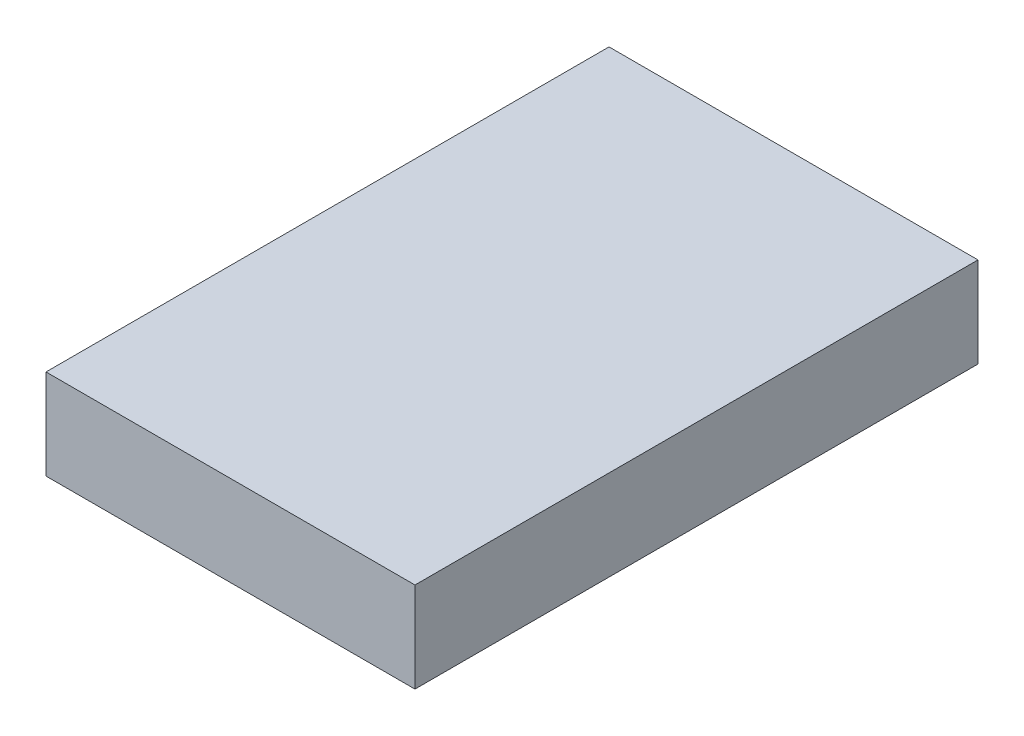
ISO-10303-21;
HEADER;
FILE_DESCRIPTION(('STEP AP214'),'2;1');
FILE_NAME('part.step','',(''),(''),'','','');
FILE_SCHEMA(('AUTOMOTIVE_DESIGN { 1 0 10303 214 1 1 1 1 }'));
ENDSEC;
DATA;
#1=APPLICATION_CONTEXT('core data for automotive mechanical design processes');
#2=APPLICATION_PROTOCOL_DEFINITION('international standard','automotive_design',2000,#1);
#3=PRODUCT_CONTEXT('',#1,'mechanical');
#4=PRODUCT('Part','Part','',(#3));
#5=PRODUCT_RELATED_PRODUCT_CATEGORY('part','',(#4));
#6=PRODUCT_DEFINITION_FORMATION('','',#4);
#7=PRODUCT_DEFINITION_CONTEXT('part definition',#1,'design');
#8=PRODUCT_DEFINITION('design','',#6,#7);
#9=PRODUCT_DEFINITION_SHAPE('','',#8);
#10=(LENGTH_UNIT() NAMED_UNIT(*) SI_UNIT(.MILLI.,.METRE.));
#11=(NAMED_UNIT(*) PLANE_ANGLE_UNIT() SI_UNIT($,.RADIAN.));
#12=(NAMED_UNIT(*) SI_UNIT($,.STERADIAN.) SOLID_ANGLE_UNIT());
#13=UNCERTAINTY_MEASURE_WITH_UNIT(LENGTH_MEASURE(1.E-05),#10,'distance_accuracy_value','');
#14=(GEOMETRIC_REPRESENTATION_CONTEXT(3) GLOBAL_UNCERTAINTY_ASSIGNED_CONTEXT((#13)) GLOBAL_UNIT_ASSIGNED_CONTEXT((#10,
#11,#12)) REPRESENTATION_CONTEXT('',''));
#15=CARTESIAN_POINT('',(0.,0.,0.));
#16=DIRECTION('',(0.,0.,1.));
#17=DIRECTION('',(1.,0.,0.));
#18=AXIS2_PLACEMENT_3D('',#15,#16,#17);
#19=CARTESIAN_POINT('',(0.,33.,0.));
#20=DIRECTION('',(1.,0.,0.));
#21=DIRECTION('',(0.,0.,-1.));
#22=AXIS2_PLACEMENT_3D('',#19,#20,#21);
#23=PLANE('',#22);
#24=DIRECTION('',(0.,0.,1.));
#25=VECTOR('',#24,1.);
#26=CARTESIAN_POINT('',(0.,0.,0.));
#27=LINE('',#26,#25);
#28=CARTESIAN_POINT('',(0.,0.,-206.));
#29=VERTEX_POINT('',#28);
#30=CARTESIAN_POINT('',(0.,0.,0.));
#31=VERTEX_POINT('',#30);
#32=EDGE_CURVE('E95',#29,#31,#27,.T.);
#33=ORIENTED_EDGE('',*,*,#32,.T.);
#34=DIRECTION('',(0.,-1.,0.));
#35=VECTOR('',#34,1.);
#36=CARTESIAN_POINT('',(0.,33.,0.));
#37=LINE('',#36,#35);
#38=CARTESIAN_POINT('',(0.,33.,0.));
#39=VERTEX_POINT('',#38);
#40=EDGE_CURVE('E11',#39,#31,#37,.T.);
#41=ORIENTED_EDGE('',*,*,#40,.F.);
#42=DIRECTION('',(0.,0.,1.));
#43=VECTOR('',#42,1.);
#44=CARTESIAN_POINT('',(0.,33.,0.));
#45=LINE('',#44,#43);
#46=CARTESIAN_POINT('',(0.,33.,-206.));
#47=VERTEX_POINT('',#46);
#48=EDGE_CURVE('E83',#47,#39,#45,.T.);
#49=ORIENTED_EDGE('',*,*,#48,.F.);
#50=DIRECTION('',(0.,-1.,0.));
#51=VECTOR('',#50,1.);
#52=CARTESIAN_POINT('',(0.,33.,-206.));
#53=LINE('',#52,#51);
#54=EDGE_CURVE('E91',#47,#29,#53,.T.);
#55=ORIENTED_EDGE('',*,*,#54,.T.);
#56=EDGE_LOOP('',(#33,#41,#49,#55));
#57=FACE_BOUND('',#56,.T.);
#58=ADVANCED_FACE('F32',(#57),#23,.F.);
#59=CARTESIAN_POINT('',(0.,33.,0.));
#60=DIRECTION('',(0.,0.,-1.));
#61=DIRECTION('',(-1.,0.,0.));
#62=AXIS2_PLACEMENT_3D('',#59,#60,#61);
#63=PLANE('',#62);
#64=DIRECTION('',(1.,0.,0.));
#65=VECTOR('',#64,1.);
#66=CARTESIAN_POINT('',(0.,0.,0.));
#67=LINE('',#66,#65);
#68=CARTESIAN_POINT('',(135.,0.,0.));
#69=VERTEX_POINT('',#68);
#70=EDGE_CURVE('E87',#31,#69,#67,.T.);
#71=ORIENTED_EDGE('',*,*,#70,.T.);
#72=DIRECTION('',(0.,-1.,0.));
#73=VECTOR('',#72,1.);
#74=CARTESIAN_POINT('',(135.,33.,0.));
#75=LINE('',#74,#73);
#76=CARTESIAN_POINT('',(135.,33.,0.));
#77=VERTEX_POINT('',#76);
#78=EDGE_CURVE('E40',#77,#69,#75,.T.);
#79=ORIENTED_EDGE('',*,*,#78,.F.);
#80=DIRECTION('',(1.,0.,0.));
#81=VECTOR('',#80,1.);
#82=CARTESIAN_POINT('',(0.,33.,0.));
#83=LINE('',#82,#81);
#84=EDGE_CURVE('E78',#39,#77,#83,.T.);
#85=ORIENTED_EDGE('',*,*,#84,.F.);
#86=ORIENTED_EDGE('',*,*,#40,.T.);
#87=EDGE_LOOP('',(#71,#79,#85,#86));
#88=FACE_BOUND('',#87,.T.);
#89=ADVANCED_FACE('F86',(#88),#63,.F.);
#90=CARTESIAN_POINT('',(135.,33.,0.));
#91=DIRECTION('',(-1.,0.,0.));
#92=DIRECTION('',(0.,0.,1.));
#93=AXIS2_PLACEMENT_3D('',#90,#91,#92);
#94=PLANE('',#93);
#95=DIRECTION('',(0.,0.,-1.));
#96=VECTOR('',#95,1.);
#97=CARTESIAN_POINT('',(135.,0.,0.));
#98=LINE('',#97,#96);
#99=CARTESIAN_POINT('',(135.,0.,-206.));
#100=VERTEX_POINT('',#99);
#101=EDGE_CURVE('E65',#69,#100,#98,.T.);
#102=ORIENTED_EDGE('',*,*,#101,.T.);
#103=DIRECTION('',(0.,-1.,0.));
#104=VECTOR('',#103,1.);
#105=CARTESIAN_POINT('',(135.,33.,-206.));
#106=LINE('',#105,#104);
#107=CARTESIAN_POINT('',(135.,33.,-206.));
#108=VERTEX_POINT('',#107);
#109=EDGE_CURVE('E88',#108,#100,#106,.T.);
#110=ORIENTED_EDGE('',*,*,#109,.F.);
#111=DIRECTION('',(0.,0.,-1.));
#112=VECTOR('',#111,1.);
#113=CARTESIAN_POINT('',(135.,33.,0.));
#114=LINE('',#113,#112);
#115=EDGE_CURVE('E81',#77,#108,#114,.T.);
#116=ORIENTED_EDGE('',*,*,#115,.F.);
#117=ORIENTED_EDGE('',*,*,#78,.T.);
#118=EDGE_LOOP('',(#102,#110,#116,#117));
#119=FACE_BOUND('',#118,.T.);
#120=ADVANCED_FACE('F89',(#119),#94,.F.);
#121=CARTESIAN_POINT('',(0.,33.,-206.));
#122=DIRECTION('',(0.,0.,1.));
#123=DIRECTION('',(1.,0.,0.));
#124=AXIS2_PLACEMENT_3D('',#121,#122,#123);
#125=PLANE('',#124);
#126=DIRECTION('',(-1.,0.,0.));
#127=VECTOR('',#126,1.);
#128=CARTESIAN_POINT('',(0.,0.,-206.));
#129=LINE('',#128,#127);
#130=EDGE_CURVE('E71',#100,#29,#129,.T.);
#131=ORIENTED_EDGE('',*,*,#130,.T.);
#132=ORIENTED_EDGE('',*,*,#54,.F.);
#133=DIRECTION('',(-1.,0.,0.));
#134=VECTOR('',#133,1.);
#135=CARTESIAN_POINT('',(0.,33.,-206.));
#136=LINE('',#135,#134);
#137=EDGE_CURVE('E48',#108,#47,#136,.T.);
#138=ORIENTED_EDGE('',*,*,#137,.F.);
#139=ORIENTED_EDGE('',*,*,#109,.T.);
#140=EDGE_LOOP('',(#131,#132,#138,#139));
#141=FACE_BOUND('',#140,.T.);
#142=ADVANCED_FACE('F102',(#141),#125,.F.);
#143=CARTESIAN_POINT('',(0.,33.,0.));
#144=DIRECTION('',(0.,-1.,0.));
#145=DIRECTION('',(0.,0.,-1.));
#146=AXIS2_PLACEMENT_3D('',#143,#144,#145);
#147=PLANE('',#146);
#148=ORIENTED_EDGE('',*,*,#48,.T.);
#149=ORIENTED_EDGE('',*,*,#84,.T.);
#150=ORIENTED_EDGE('',*,*,#115,.T.);
#151=ORIENTED_EDGE('',*,*,#137,.T.);
#152=EDGE_LOOP('',(#148,#149,#150,#151));
#153=FACE_BOUND('',#152,.T.);
#154=ADVANCED_FACE('F79',(#153),#147,.F.);
#155=CARTESIAN_POINT('',(0.,0.,0.));
#156=DIRECTION('',(0.,-1.,0.));
#157=DIRECTION('',(0.,0.,-1.));
#158=AXIS2_PLACEMENT_3D('',#155,#156,#157);
#159=PLANE('',#158);
#160=ORIENTED_EDGE('',*,*,#32,.F.);
#161=ORIENTED_EDGE('',*,*,#130,.F.);
#162=ORIENTED_EDGE('',*,*,#101,.F.);
#163=ORIENTED_EDGE('',*,*,#70,.F.);
#164=EDGE_LOOP('',(#160,#161,#162,#163));
#165=FACE_BOUND('',#164,.T.);
#166=ADVANCED_FACE('F105',(#165),#159,.T.);
#167=CLOSED_SHELL('',(#58,#89,#120,#142,#154,#166));
#168=MANIFOLD_SOLID_BREP('B2',#167);
#169=ADVANCED_BREP_SHAPE_REPRESENTATION('',(#18,#168),#14);
#170=SHAPE_DEFINITION_REPRESENTATION(#9,#169);
ENDSEC;
END-ISO-10303-21;
